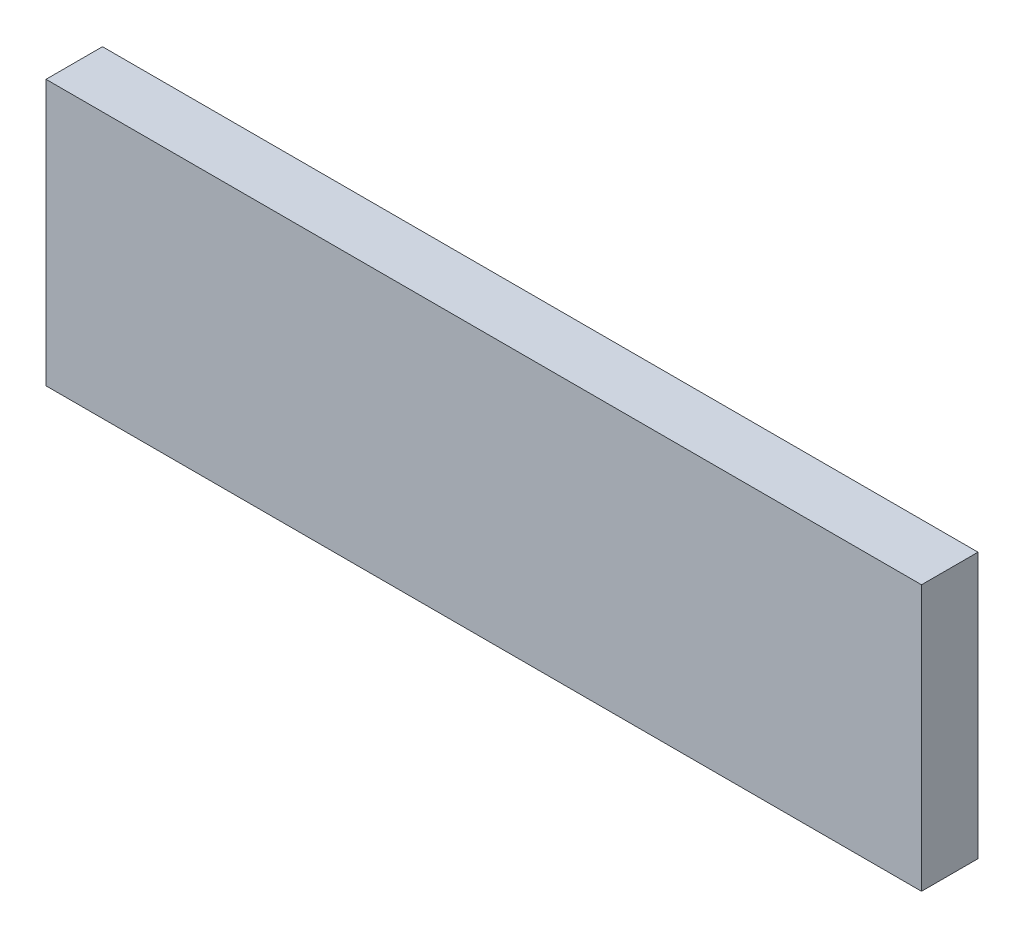
ISO-10303-21;
HEADER;
FILE_DESCRIPTION(('STEP AP214'),'2;1');
FILE_NAME('part.step','',(''),(''),'','','');
FILE_SCHEMA(('AUTOMOTIVE_DESIGN { 1 0 10303 214 1 1 1 1 }'));
ENDSEC;
DATA;
#1=APPLICATION_CONTEXT('core data for automotive mechanical design processes');
#2=APPLICATION_PROTOCOL_DEFINITION('international standard','automotive_design',2000,#1);
#3=PRODUCT_CONTEXT('',#1,'mechanical');
#4=PRODUCT('Part','Part','',(#3));
#5=PRODUCT_RELATED_PRODUCT_CATEGORY('part','',(#4));
#6=PRODUCT_DEFINITION_FORMATION('','',#4);
#7=PRODUCT_DEFINITION_CONTEXT('part definition',#1,'design');
#8=PRODUCT_DEFINITION('design','',#6,#7);
#9=PRODUCT_DEFINITION_SHAPE('','',#8);
#10=(LENGTH_UNIT() NAMED_UNIT(*) SI_UNIT(.MILLI.,.METRE.));
#11=(NAMED_UNIT(*) PLANE_ANGLE_UNIT() SI_UNIT($,.RADIAN.));
#12=(NAMED_UNIT(*) SI_UNIT($,.STERADIAN.) SOLID_ANGLE_UNIT());
#13=UNCERTAINTY_MEASURE_WITH_UNIT(LENGTH_MEASURE(1.E-05),#10,'distance_accuracy_value','');
#14=(GEOMETRIC_REPRESENTATION_CONTEXT(3) GLOBAL_UNCERTAINTY_ASSIGNED_CONTEXT((#13)) GLOBAL_UNIT_ASSIGNED_CONTEXT((#10,
#11,#12)) REPRESENTATION_CONTEXT('',''));
#15=CARTESIAN_POINT('',(0.,0.,0.));
#16=DIRECTION('',(0.,0.,1.));
#17=DIRECTION('',(1.,0.,0.));
#18=AXIS2_PLACEMENT_3D('',#15,#16,#17);
#19=CARTESIAN_POINT('',(0.,0.,10.));
#20=DIRECTION('',(1.,0.,0.));
#21=DIRECTION('',(0.,0.,-1.));
#22=AXIS2_PLACEMENT_3D('',#19,#20,#21);
#23=PLANE('',#22);
#24=DIRECTION('',(0.,-1.,0.));
#25=VECTOR('',#24,1.);
#26=CARTESIAN_POINT('',(0.,0.,0.));
#27=LINE('',#26,#25);
#28=CARTESIAN_POINT('',(0.,47.,0.));
#29=VERTEX_POINT('',#28);
#30=CARTESIAN_POINT('',(0.,0.,0.));
#31=VERTEX_POINT('',#30);
#32=EDGE_CURVE('E97',#29,#31,#27,.T.);
#33=ORIENTED_EDGE('',*,*,#32,.T.);
#34=DIRECTION('',(0.,0.,-1.));
#35=VECTOR('',#34,1.);
#36=CARTESIAN_POINT('',(0.,0.,10.));
#37=LINE('',#36,#35);
#38=CARTESIAN_POINT('',(0.,0.,10.));
#39=VERTEX_POINT('',#38);
#40=EDGE_CURVE('E11',#39,#31,#37,.T.);
#41=ORIENTED_EDGE('',*,*,#40,.F.);
#42=DIRECTION('',(0.,-1.,0.));
#43=VECTOR('',#42,1.);
#44=CARTESIAN_POINT('',(0.,0.,10.));
#45=LINE('',#44,#43);
#46=CARTESIAN_POINT('',(0.,47.,10.));
#47=VERTEX_POINT('',#46);
#48=EDGE_CURVE('E85',#47,#39,#45,.T.);
#49=ORIENTED_EDGE('',*,*,#48,.F.);
#50=DIRECTION('',(0.,0.,-1.));
#51=VECTOR('',#50,1.);
#52=CARTESIAN_POINT('',(0.,47.,10.));
#53=LINE('',#52,#51);
#54=EDGE_CURVE('E93',#47,#29,#53,.T.);
#55=ORIENTED_EDGE('',*,*,#54,.T.);
#56=EDGE_LOOP('',(#33,#41,#49,#55));
#57=FACE_BOUND('',#56,.T.);
#58=ADVANCED_FACE('F34',(#57),#23,.F.);
#59=CARTESIAN_POINT('',(0.,0.,10.));
#60=DIRECTION('',(0.,1.,0.));
#61=DIRECTION('',(0.,0.,1.));
#62=AXIS2_PLACEMENT_3D('',#59,#60,#61);
#63=PLANE('',#62);
#64=DIRECTION('',(1.,0.,0.));
#65=VECTOR('',#64,1.);
#66=CARTESIAN_POINT('',(0.,0.,0.));
#67=LINE('',#66,#65);
#68=CARTESIAN_POINT('',(155.,0.,0.));
#69=VERTEX_POINT('',#68);
#70=EDGE_CURVE('E89',#31,#69,#67,.T.);
#71=ORIENTED_EDGE('',*,*,#70,.T.);
#72=DIRECTION('',(0.,0.,-1.));
#73=VECTOR('',#72,1.);
#74=CARTESIAN_POINT('',(155.,0.,10.));
#75=LINE('',#74,#73);
#76=CARTESIAN_POINT('',(155.,0.,10.));
#77=VERTEX_POINT('',#76);
#78=EDGE_CURVE('E42',#77,#69,#75,.T.);
#79=ORIENTED_EDGE('',*,*,#78,.F.);
#80=DIRECTION('',(1.,0.,0.));
#81=VECTOR('',#80,1.);
#82=CARTESIAN_POINT('',(0.,0.,10.));
#83=LINE('',#82,#81);
#84=EDGE_CURVE('E80',#39,#77,#83,.T.);
#85=ORIENTED_EDGE('',*,*,#84,.F.);
#86=ORIENTED_EDGE('',*,*,#40,.T.);
#87=EDGE_LOOP('',(#71,#79,#85,#86));
#88=FACE_BOUND('',#87,.T.);
#89=ADVANCED_FACE('F88',(#88),#63,.F.);
#90=CARTESIAN_POINT('',(155.,0.,10.));
#91=DIRECTION('',(-1.,0.,0.));
#92=DIRECTION('',(0.,0.,1.));
#93=AXIS2_PLACEMENT_3D('',#90,#91,#92);
#94=PLANE('',#93);
#95=DIRECTION('',(0.,1.,0.));
#96=VECTOR('',#95,1.);
#97=CARTESIAN_POINT('',(155.,0.,0.));
#98=LINE('',#97,#96);
#99=CARTESIAN_POINT('',(155.,47.,0.));
#100=VERTEX_POINT('',#99);
#101=EDGE_CURVE('E67',#69,#100,#98,.T.);
#102=ORIENTED_EDGE('',*,*,#101,.T.);
#103=DIRECTION('',(0.,0.,-1.));
#104=VECTOR('',#103,1.);
#105=CARTESIAN_POINT('',(155.,47.,10.));
#106=LINE('',#105,#104);
#107=CARTESIAN_POINT('',(155.,47.,10.));
#108=VERTEX_POINT('',#107);
#109=EDGE_CURVE('E90',#108,#100,#106,.T.);
#110=ORIENTED_EDGE('',*,*,#109,.F.);
#111=DIRECTION('',(0.,1.,0.));
#112=VECTOR('',#111,1.);
#113=CARTESIAN_POINT('',(155.,0.,10.));
#114=LINE('',#113,#112);
#115=EDGE_CURVE('E83',#77,#108,#114,.T.);
#116=ORIENTED_EDGE('',*,*,#115,.F.);
#117=ORIENTED_EDGE('',*,*,#78,.T.);
#118=EDGE_LOOP('',(#102,#110,#116,#117));
#119=FACE_BOUND('',#118,.T.);
#120=ADVANCED_FACE('F91',(#119),#94,.F.);
#121=CARTESIAN_POINT('',(0.,47.,10.));
#122=DIRECTION('',(0.,-1.,0.));
#123=DIRECTION('',(0.,0.,-1.));
#124=AXIS2_PLACEMENT_3D('',#121,#122,#123);
#125=PLANE('',#124);
#126=DIRECTION('',(-1.,0.,0.));
#127=VECTOR('',#126,1.);
#128=CARTESIAN_POINT('',(0.,47.,0.));
#129=LINE('',#128,#127);
#130=EDGE_CURVE('E73',#100,#29,#129,.T.);
#131=ORIENTED_EDGE('',*,*,#130,.T.);
#132=ORIENTED_EDGE('',*,*,#54,.F.);
#133=DIRECTION('',(-1.,0.,0.));
#134=VECTOR('',#133,1.);
#135=CARTESIAN_POINT('',(0.,47.,10.));
#136=LINE('',#135,#134);
#137=EDGE_CURVE('E50',#108,#47,#136,.T.);
#138=ORIENTED_EDGE('',*,*,#137,.F.);
#139=ORIENTED_EDGE('',*,*,#109,.T.);
#140=EDGE_LOOP('',(#131,#132,#138,#139));
#141=FACE_BOUND('',#140,.T.);
#142=ADVANCED_FACE('F104',(#141),#125,.F.);
#143=CARTESIAN_POINT('',(0.,0.,10.));
#144=DIRECTION('',(0.,0.,-1.));
#145=DIRECTION('',(-1.,0.,0.));
#146=AXIS2_PLACEMENT_3D('',#143,#144,#145);
#147=PLANE('',#146);
#148=ORIENTED_EDGE('',*,*,#48,.T.);
#149=ORIENTED_EDGE('',*,*,#84,.T.);
#150=ORIENTED_EDGE('',*,*,#115,.T.);
#151=ORIENTED_EDGE('',*,*,#137,.T.);
#152=EDGE_LOOP('',(#148,#149,#150,#151));
#153=FACE_BOUND('',#152,.T.);
#154=ADVANCED_FACE('F81',(#153),#147,.F.);
#155=CARTESIAN_POINT('',(0.,0.,0.));
#156=DIRECTION('',(0.,0.,-1.));
#157=DIRECTION('',(-1.,0.,0.));
#158=AXIS2_PLACEMENT_3D('',#155,#156,#157);
#159=PLANE('',#158);
#160=ORIENTED_EDGE('',*,*,#32,.F.);
#161=ORIENTED_EDGE('',*,*,#130,.F.);
#162=ORIENTED_EDGE('',*,*,#101,.F.);
#163=ORIENTED_EDGE('',*,*,#70,.F.);
#164=EDGE_LOOP('',(#160,#161,#162,#163));
#165=FACE_BOUND('',#164,.T.);
#166=ADVANCED_FACE('F107',(#165),#159,.T.);
#167=CLOSED_SHELL('',(#58,#89,#120,#142,#154,#166));
#168=MANIFOLD_SOLID_BREP('B2',#167);
#169=ADVANCED_BREP_SHAPE_REPRESENTATION('',(#18,#168),#14);
#170=SHAPE_DEFINITION_REPRESENTATION(#9,#169);
ENDSEC;
END-ISO-10303-21;
